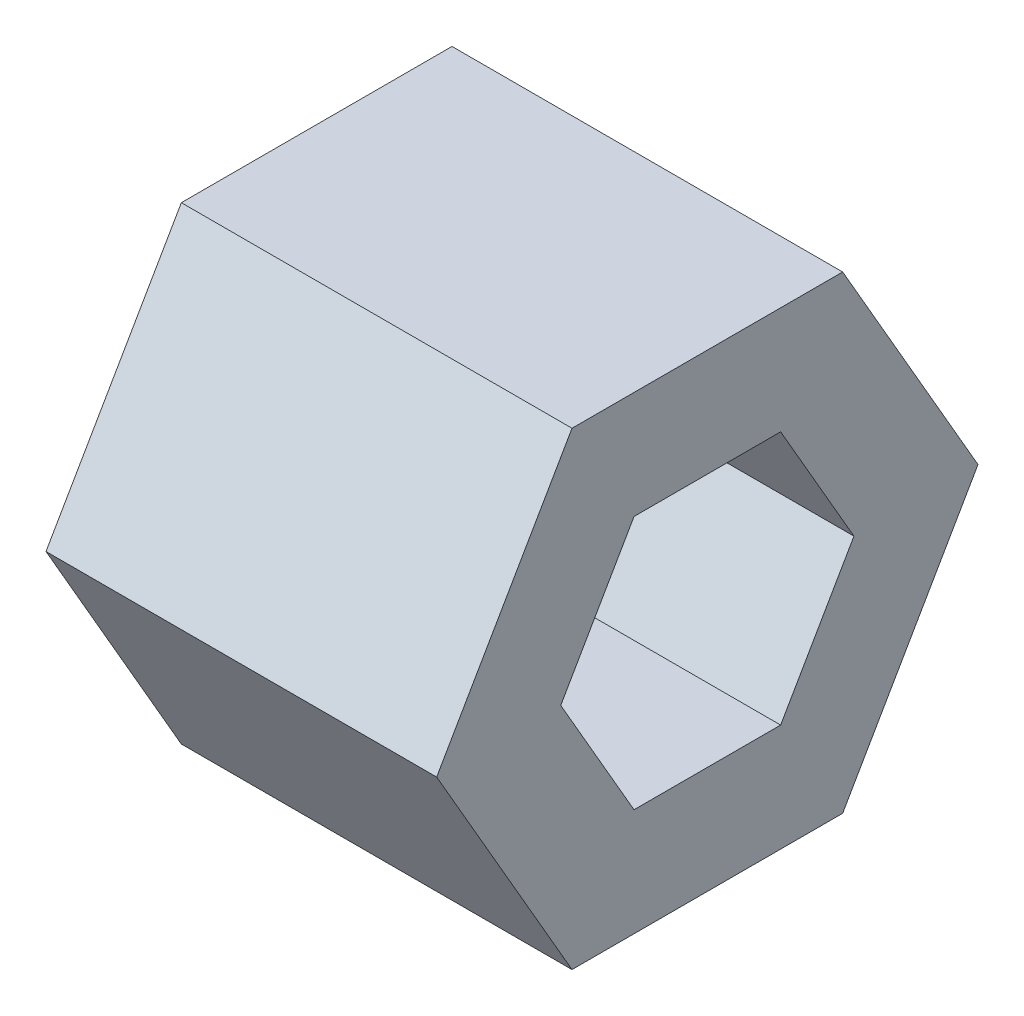
ISO-10303-21;
HEADER;
FILE_DESCRIPTION(('STEP AP214'),'2;1');
FILE_NAME('part.step','',(''),(''),'','','');
FILE_SCHEMA(('AUTOMOTIVE_DESIGN { 1 0 10303 214 1 1 1 1 }'));
ENDSEC;
DATA;
#1=APPLICATION_CONTEXT('core data for automotive mechanical design processes');
#2=APPLICATION_PROTOCOL_DEFINITION('international standard','automotive_design',2000,#1);
#3=PRODUCT_CONTEXT('',#1,'mechanical');
#4=PRODUCT('Part','Part','',(#3));
#5=PRODUCT_RELATED_PRODUCT_CATEGORY('part','',(#4));
#6=PRODUCT_DEFINITION_FORMATION('','',#4);
#7=PRODUCT_DEFINITION_CONTEXT('part definition',#1,'design');
#8=PRODUCT_DEFINITION('design','',#6,#7);
#9=PRODUCT_DEFINITION_SHAPE('','',#8);
#10=(LENGTH_UNIT() NAMED_UNIT(*) SI_UNIT(.MILLI.,.METRE.));
#11=(NAMED_UNIT(*) PLANE_ANGLE_UNIT() SI_UNIT($,.RADIAN.));
#12=(NAMED_UNIT(*) SI_UNIT($,.STERADIAN.) SOLID_ANGLE_UNIT());
#13=UNCERTAINTY_MEASURE_WITH_UNIT(LENGTH_MEASURE(1.E-05),#10,'distance_accuracy_value','');
#14=(GEOMETRIC_REPRESENTATION_CONTEXT(3) GLOBAL_UNCERTAINTY_ASSIGNED_CONTEXT((#13)) GLOBAL_UNIT_ASSIGNED_CONTEXT((#10,
#11,#12)) REPRESENTATION_CONTEXT('',''));
#15=CARTESIAN_POINT('',(0.,0.,0.));
#16=DIRECTION('',(0.,0.,1.));
#17=DIRECTION('',(1.,0.,0.));
#18=AXIS2_PLACEMENT_3D('',#15,#16,#17);
#19=CARTESIAN_POINT('',(10.,-5.99999999999996,-3.46410161513783));
#20=DIRECTION('',(0.,0.499999999999995,0.866025403784442));
#21=DIRECTION('',(0.,-0.866025403784442,0.499999999999995));
#22=AXIS2_PLACEMENT_3D('',#19,#20,#21);
#23=PLANE('',#22);
#24=DIRECTION('',(0.,0.866025403784442,-0.499999999999995));
#25=VECTOR('',#24,1.);
#26=CARTESIAN_POINT('',(0.,-5.99999999999996,-3.46410161513783));
#27=LINE('',#26,#25);
#28=CARTESIAN_POINT('',(0.,-5.99999999999996,-3.46410161513783));
#29=VERTEX_POINT('',#28);
#30=CARTESIAN_POINT('',(0.,0.,-6.92820323027551));
#31=VERTEX_POINT('',#30);
#32=EDGE_CURVE('E130',#29,#31,#27,.T.);
#33=ORIENTED_EDGE('',*,*,#32,.T.);
#34=DIRECTION('',(-1.,0.,0.));
#35=VECTOR('',#34,1.);
#36=CARTESIAN_POINT('',(10.,0.,-6.92820323027551));
#37=LINE('',#36,#35);
#38=CARTESIAN_POINT('',(10.,0.,-6.92820323027551));
#39=VERTEX_POINT('',#38);
#40=EDGE_CURVE('E11',#39,#31,#37,.T.);
#41=ORIENTED_EDGE('',*,*,#40,.F.);
#42=DIRECTION('',(0.,0.866025403784442,-0.499999999999995));
#43=VECTOR('',#42,1.);
#44=CARTESIAN_POINT('',(10.,-5.99999999999996,-3.46410161513783));
#45=LINE('',#44,#43);
#46=CARTESIAN_POINT('',(10.,-5.99999999999996,-3.46410161513783));
#47=VERTEX_POINT('',#46);
#48=EDGE_CURVE('E142',#47,#39,#45,.T.);
#49=ORIENTED_EDGE('',*,*,#48,.F.);
#50=DIRECTION('',(-1.,0.,0.));
#51=VECTOR('',#50,1.);
#52=CARTESIAN_POINT('',(10.,-5.99999999999996,-3.46410161513783));
#53=LINE('',#52,#51);
#54=EDGE_CURVE('E126',#47,#29,#53,.T.);
#55=ORIENTED_EDGE('',*,*,#54,.T.);
#56=EDGE_LOOP('',(#33,#41,#49,#55));
#57=FACE_BOUND('',#56,.T.);
#58=ADVANCED_FACE('F34',(#57),#23,.F.);
#59=CARTESIAN_POINT('',(10.,0.,-6.92820323027551));
#60=DIRECTION('',(0.,-0.500000000000001,0.866025403784438));
#61=DIRECTION('',(0.,-0.866025403784438,-0.500000000000001));
#62=AXIS2_PLACEMENT_3D('',#59,#60,#61);
#63=PLANE('',#62);
#64=DIRECTION('',(0.,0.866025403784438,0.500000000000001));
#65=VECTOR('',#64,1.);
#66=CARTESIAN_POINT('',(0.,0.,-6.92820323027551));
#67=LINE('',#66,#65);
#68=CARTESIAN_POINT('',(0.,6.00000000000001,-3.46410161513774));
#69=VERTEX_POINT('',#68);
#70=EDGE_CURVE('E133',#31,#69,#67,.T.);
#71=ORIENTED_EDGE('',*,*,#70,.T.);
#72=DIRECTION('',(-1.,0.,0.));
#73=VECTOR('',#72,1.);
#74=CARTESIAN_POINT('',(10.,6.00000000000001,-3.46410161513774));
#75=LINE('',#74,#73);
#76=CARTESIAN_POINT('',(10.,6.00000000000001,-3.46410161513774));
#77=VERTEX_POINT('',#76);
#78=EDGE_CURVE('E41',#77,#69,#75,.T.);
#79=ORIENTED_EDGE('',*,*,#78,.F.);
#80=DIRECTION('',(0.,0.866025403784438,0.500000000000001));
#81=VECTOR('',#80,1.);
#82=CARTESIAN_POINT('',(10.,0.,-6.92820323027551));
#83=LINE('',#82,#81);
#84=EDGE_CURVE('E92',#39,#77,#83,.T.);
#85=ORIENTED_EDGE('',*,*,#84,.F.);
#86=ORIENTED_EDGE('',*,*,#40,.T.);
#87=EDGE_LOOP('',(#71,#79,#85,#86));
#88=FACE_BOUND('',#87,.T.);
#89=ADVANCED_FACE('F277',(#88),#63,.F.);
#90=CARTESIAN_POINT('',(10.,6.00000000000001,-3.46410161513774));
#91=DIRECTION('',(0.,-1.,0.));
#92=DIRECTION('',(0.,0.,-1.));
#93=AXIS2_PLACEMENT_3D('',#90,#91,#92);
#94=PLANE('',#93);
#95=DIRECTION('',(0.,0.,1.));
#96=VECTOR('',#95,1.);
#97=CARTESIAN_POINT('',(0.,6.00000000000001,-3.46410161513774));
#98=LINE('',#97,#96);
#99=CARTESIAN_POINT('',(0.,5.99999999999999,3.46410161513779));
#100=VERTEX_POINT('',#99);
#101=EDGE_CURVE('E136',#69,#100,#98,.T.);
#102=ORIENTED_EDGE('',*,*,#101,.T.);
#103=DIRECTION('',(-1.,0.,0.));
#104=VECTOR('',#103,1.);
#105=CARTESIAN_POINT('',(10.,5.99999999999999,3.46410161513779));
#106=LINE('',#105,#104);
#107=CARTESIAN_POINT('',(10.,5.99999999999999,3.46410161513779));
#108=VERTEX_POINT('',#107);
#109=EDGE_CURVE('E121',#108,#100,#106,.T.);
#110=ORIENTED_EDGE('',*,*,#109,.F.);
#111=DIRECTION('',(0.,0.,1.));
#112=VECTOR('',#111,1.);
#113=CARTESIAN_POINT('',(10.,6.00000000000001,-3.46410161513774));
#114=LINE('',#113,#112);
#115=EDGE_CURVE('E109',#77,#108,#114,.T.);
#116=ORIENTED_EDGE('',*,*,#115,.F.);
#117=ORIENTED_EDGE('',*,*,#78,.T.);
#118=EDGE_LOOP('',(#102,#110,#116,#117));
#119=FACE_BOUND('',#118,.T.);
#120=ADVANCED_FACE('F148',(#119),#94,.F.);
#121=CARTESIAN_POINT('',(10.,5.99999999999999,3.46410161513779));
#122=DIRECTION('',(0.,-0.499999999999995,-0.866025403784442));
#123=DIRECTION('',(0.,0.866025403784442,-0.499999999999995));
#124=AXIS2_PLACEMENT_3D('',#121,#122,#123);
#125=PLANE('',#124);
#126=DIRECTION('',(0.,-0.866025403784441,0.499999999999995));
#127=VECTOR('',#126,1.);
#128=CARTESIAN_POINT('',(0.,5.99999999999999,3.46410161513779));
#129=LINE('',#128,#127);
#130=CARTESIAN_POINT('',(0.,0.,6.92820323027551));
#131=VERTEX_POINT('',#130);
#132=EDGE_CURVE('E118',#100,#131,#129,.T.);
#133=ORIENTED_EDGE('',*,*,#132,.T.);
#134=DIRECTION('',(-1.,0.,0.));
#135=VECTOR('',#134,1.);
#136=CARTESIAN_POINT('',(10.,0.,6.92820323027551));
#137=LINE('',#136,#135);
#138=CARTESIAN_POINT('',(10.,0.,6.92820323027551));
#139=VERTEX_POINT('',#138);
#140=EDGE_CURVE('E115',#139,#131,#137,.T.);
#141=ORIENTED_EDGE('',*,*,#140,.F.);
#142=DIRECTION('',(0.,-0.866025403784441,0.499999999999995));
#143=VECTOR('',#142,1.);
#144=CARTESIAN_POINT('',(10.,5.99999999999999,3.46410161513779));
#145=LINE('',#144,#143);
#146=EDGE_CURVE('E102',#108,#139,#145,.T.);
#147=ORIENTED_EDGE('',*,*,#146,.F.);
#148=ORIENTED_EDGE('',*,*,#109,.T.);
#149=EDGE_LOOP('',(#133,#141,#147,#148));
#150=FACE_BOUND('',#149,.T.);
#151=ADVANCED_FACE('F116',(#150),#125,.F.);
#152=CARTESIAN_POINT('',(10.,0.,6.92820323027551));
#153=DIRECTION('',(0.,0.500000000000007,-0.866025403784435));
#154=DIRECTION('',(0.,0.866025403784435,0.500000000000007));
#155=AXIS2_PLACEMENT_3D('',#152,#153,#154);
#156=PLANE('',#155);
#157=DIRECTION('',(0.,-0.866025403784434,-0.500000000000007));
#158=VECTOR('',#157,1.);
#159=CARTESIAN_POINT('',(0.,0.,6.92820323027551));
#160=LINE('',#159,#158);
#161=CARTESIAN_POINT('',(0.,-6.00000000000004,3.4641016151377));
#162=VERTEX_POINT('',#161);
#163=EDGE_CURVE('E139',#131,#162,#160,.T.);
#164=ORIENTED_EDGE('',*,*,#163,.T.);
#165=DIRECTION('',(-1.,0.,0.));
#166=VECTOR('',#165,1.);
#167=CARTESIAN_POINT('',(10.,-6.00000000000004,3.4641016151377));
#168=LINE('',#167,#166);
#169=CARTESIAN_POINT('',(10.,-6.00000000000004,3.4641016151377));
#170=VERTEX_POINT('',#169);
#171=EDGE_CURVE('E122',#170,#162,#168,.T.);
#172=ORIENTED_EDGE('',*,*,#171,.F.);
#173=DIRECTION('',(0.,-0.866025403784434,-0.500000000000007));
#174=VECTOR('',#173,1.);
#175=CARTESIAN_POINT('',(10.,0.,6.92820323027551));
#176=LINE('',#175,#174);
#177=EDGE_CURVE('E106',#139,#170,#176,.T.);
#178=ORIENTED_EDGE('',*,*,#177,.F.);
#179=ORIENTED_EDGE('',*,*,#140,.T.);
#180=EDGE_LOOP('',(#164,#172,#178,#179));
#181=FACE_BOUND('',#180,.T.);
#182=ADVANCED_FACE('F124',(#181),#156,.F.);
#183=CARTESIAN_POINT('',(10.,-6.00000000000004,3.4641016151377));
#184=DIRECTION('',(0.,1.,0.));
#185=DIRECTION('',(0.,0.,1.));
#186=AXIS2_PLACEMENT_3D('',#183,#184,#185);
#187=PLANE('',#186);
#188=DIRECTION('',(0.,0.,-1.));
#189=VECTOR('',#188,1.);
#190=CARTESIAN_POINT('',(0.,-6.00000000000004,3.4641016151377));
#191=LINE('',#190,#189);
#192=EDGE_CURVE('E84',#162,#29,#191,.T.);
#193=ORIENTED_EDGE('',*,*,#192,.T.);
#194=ORIENTED_EDGE('',*,*,#54,.F.);
#195=DIRECTION('',(0.,0.,-1.));
#196=VECTOR('',#195,1.);
#197=CARTESIAN_POINT('',(10.,-6.00000000000004,3.4641016151377));
#198=LINE('',#197,#196);
#199=EDGE_CURVE('E57',#170,#47,#198,.T.);
#200=ORIENTED_EDGE('',*,*,#199,.F.);
#201=ORIENTED_EDGE('',*,*,#171,.T.);
#202=EDGE_LOOP('',(#193,#194,#200,#201));
#203=FACE_BOUND('',#202,.T.);
#204=ADVANCED_FACE('F152',(#203),#187,.F.);
#205=CARTESIAN_POINT('',(10.,0.,0.));
#206=DIRECTION('',(1.,0.,0.));
#207=DIRECTION('',(0.,0.,-1.));
#208=AXIS2_PLACEMENT_3D('',#205,#206,#207);
#209=PLANE('',#208);
#210=DIRECTION('',(0.,0.866025403784439,-0.5));
#211=VECTOR('',#210,1.);
#212=CARTESIAN_POINT('',(10.,-3.25,-1.87638837486628));
#213=LINE('',#212,#211);
#214=CARTESIAN_POINT('',(10.,-3.25,-1.87638837486628));
#215=VERTEX_POINT('',#214);
#216=CARTESIAN_POINT('',(10.,0.,-3.75277674973257));
#217=VERTEX_POINT('',#216);
#218=EDGE_CURVE('E48',#215,#217,#213,.T.);
#219=ORIENTED_EDGE('',*,*,#218,.F.);
#220=DIRECTION('',(0.,0.,-1.));
#221=VECTOR('',#220,1.);
#222=CARTESIAN_POINT('',(10.,-3.25,1.87638837486628));
#223=LINE('',#222,#221);
#224=CARTESIAN_POINT('',(10.,-3.25,1.87638837486628));
#225=VERTEX_POINT('',#224);
#226=EDGE_CURVE('E175',#225,#215,#223,.T.);
#227=ORIENTED_EDGE('',*,*,#226,.F.);
#228=DIRECTION('',(0.,-0.866025403784438,-0.5));
#229=VECTOR('',#228,1.);
#230=CARTESIAN_POINT('',(10.,0.,3.75277674973257));
#231=LINE('',#230,#229);
#232=CARTESIAN_POINT('',(10.,0.,3.75277674973257));
#233=VERTEX_POINT('',#232);
#234=EDGE_CURVE('E179',#233,#225,#231,.T.);
#235=ORIENTED_EDGE('',*,*,#234,.F.);
#236=DIRECTION('',(0.,-0.866025403784439,0.5));
#237=VECTOR('',#236,1.);
#238=CARTESIAN_POINT('',(10.,3.25,1.87638837486628));
#239=LINE('',#238,#237);
#240=CARTESIAN_POINT('',(10.,3.25,1.87638837486628));
#241=VERTEX_POINT('',#240);
#242=EDGE_CURVE('E182',#241,#233,#239,.T.);
#243=ORIENTED_EDGE('',*,*,#242,.F.);
#244=DIRECTION('',(0.,0.,1.));
#245=VECTOR('',#244,1.);
#246=CARTESIAN_POINT('',(10.,3.25,-1.87638837486628));
#247=LINE('',#246,#245);
#248=CARTESIAN_POINT('',(10.,3.25,-1.87638837486628));
#249=VERTEX_POINT('',#248);
#250=EDGE_CURVE('E185',#249,#241,#247,.T.);
#251=ORIENTED_EDGE('',*,*,#250,.F.);
#252=DIRECTION('',(0.,0.866025403784439,0.5));
#253=VECTOR('',#252,1.);
#254=CARTESIAN_POINT('',(10.,0.,-3.75277674973257));
#255=LINE('',#254,#253);
#256=EDGE_CURVE('E188',#217,#249,#255,.T.);
#257=ORIENTED_EDGE('',*,*,#256,.F.);
#258=EDGE_LOOP('',(#219,#227,#235,#243,#251,#257));
#259=FACE_BOUND('',#258,.T.);
#260=ORIENTED_EDGE('',*,*,#48,.T.);
#261=ORIENTED_EDGE('',*,*,#84,.T.);
#262=ORIENTED_EDGE('',*,*,#115,.T.);
#263=ORIENTED_EDGE('',*,*,#146,.T.);
#264=ORIENTED_EDGE('',*,*,#177,.T.);
#265=ORIENTED_EDGE('',*,*,#199,.T.);
#266=EDGE_LOOP('',(#260,#261,#262,#263,#264,#265));
#267=FACE_BOUND('',#266,.T.);
#268=ADVANCED_FACE('F104',(#259,#267),#209,.T.);
#269=CARTESIAN_POINT('',(0.,0.,0.));
#270=DIRECTION('',(1.,0.,0.));
#271=DIRECTION('',(0.,0.,-1.));
#272=AXIS2_PLACEMENT_3D('',#269,#270,#271);
#273=PLANE('',#272);
#274=CARTESIAN_POINT('',(0.,0.,0.));
#275=DIRECTION('',(1.,0.,0.));
#276=DIRECTION('',(0.,0.,-1.));
#277=AXIS2_PLACEMENT_3D('',#274,#275,#276);
#278=CIRCLE('',#277,1.5);
#279=CARTESIAN_POINT('',(0.,0.,-1.5));
#280=VERTEX_POINT('',#279);
#281=EDGE_CURVE('E192',#280,#280,#278,.T.);
#282=ORIENTED_EDGE('',*,*,#281,.T.);
#283=EDGE_LOOP('',(#282));
#284=FACE_BOUND('',#283,.T.);
#285=ORIENTED_EDGE('',*,*,#32,.F.);
#286=ORIENTED_EDGE('',*,*,#192,.F.);
#287=ORIENTED_EDGE('',*,*,#163,.F.);
#288=ORIENTED_EDGE('',*,*,#132,.F.);
#289=ORIENTED_EDGE('',*,*,#101,.F.);
#290=ORIENTED_EDGE('',*,*,#70,.F.);
#291=EDGE_LOOP('',(#285,#286,#287,#288,#289,#290));
#292=FACE_BOUND('',#291,.T.);
#293=ADVANCED_FACE('F151',(#284,#292),#273,.F.);
#294=CARTESIAN_POINT('',(3.,-3.25,-1.87638837486628));
#295=DIRECTION('',(0.,-0.5,-0.866025403784439));
#296=DIRECTION('',(0.,0.866025403784439,-0.5));
#297=AXIS2_PLACEMENT_3D('',#294,#295,#296);
#298=PLANE('',#297);
#299=ORIENTED_EDGE('',*,*,#218,.T.);
#300=DIRECTION('',(1.,0.,0.));
#301=VECTOR('',#300,1.);
#302=CARTESIAN_POINT('',(3.,0.,-3.75277674973257));
#303=LINE('',#302,#301);
#304=CARTESIAN_POINT('',(3.,0.,-3.75277674973257));
#305=VERTEX_POINT('',#304);
#306=EDGE_CURVE('E159',#305,#217,#303,.T.);
#307=ORIENTED_EDGE('',*,*,#306,.F.);
#308=DIRECTION('',(0.,0.866025403784439,-0.5));
#309=VECTOR('',#308,1.);
#310=CARTESIAN_POINT('',(3.,-3.25,-1.87638837486628));
#311=LINE('',#310,#309);
#312=CARTESIAN_POINT('',(3.,-3.25,-1.87638837486628));
#313=VERTEX_POINT('',#312);
#314=EDGE_CURVE('E178',#313,#305,#311,.T.);
#315=ORIENTED_EDGE('',*,*,#314,.F.);
#316=DIRECTION('',(1.,0.,0.));
#317=VECTOR('',#316,1.);
#318=CARTESIAN_POINT('',(3.,-3.25,-1.87638837486628));
#319=LINE('',#318,#317);
#320=EDGE_CURVE('E134',#313,#215,#319,.T.);
#321=ORIENTED_EDGE('',*,*,#320,.T.);
#322=EDGE_LOOP('',(#299,#307,#315,#321));
#323=FACE_BOUND('',#322,.T.);
#324=ADVANCED_FACE('F229',(#323),#298,.F.);
#325=CARTESIAN_POINT('',(3.,-3.25,1.87638837486628));
#326=DIRECTION('',(0.,-1.,0.));
#327=DIRECTION('',(0.,0.,-1.));
#328=AXIS2_PLACEMENT_3D('',#325,#326,#327);
#329=PLANE('',#328);
#330=ORIENTED_EDGE('',*,*,#226,.T.);
#331=ORIENTED_EDGE('',*,*,#320,.F.);
#332=DIRECTION('',(0.,0.,-1.));
#333=VECTOR('',#332,1.);
#334=CARTESIAN_POINT('',(3.,-3.25,1.87638837486628));
#335=LINE('',#334,#333);
#336=CARTESIAN_POINT('',(3.,-3.25,1.87638837486628));
#337=VERTEX_POINT('',#336);
#338=EDGE_CURVE('E162',#337,#313,#335,.T.);
#339=ORIENTED_EDGE('',*,*,#338,.F.);
#340=DIRECTION('',(1.,0.,0.));
#341=VECTOR('',#340,1.);
#342=CARTESIAN_POINT('',(3.,-3.25,1.87638837486628));
#343=LINE('',#342,#341);
#344=EDGE_CURVE('E171',#337,#225,#343,.T.);
#345=ORIENTED_EDGE('',*,*,#344,.T.);
#346=EDGE_LOOP('',(#330,#331,#339,#345));
#347=FACE_BOUND('',#346,.T.);
#348=ADVANCED_FACE('F245',(#347),#329,.F.);
#349=CARTESIAN_POINT('',(3.,0.,3.75277674973257));
#350=DIRECTION('',(0.,-0.5,0.866025403784438));
#351=DIRECTION('',(0.,-0.866025403784439,-0.5));
#352=AXIS2_PLACEMENT_3D('',#349,#350,#351);
#353=PLANE('',#352);
#354=ORIENTED_EDGE('',*,*,#234,.T.);
#355=ORIENTED_EDGE('',*,*,#344,.F.);
#356=DIRECTION('',(0.,-0.866025403784438,-0.5));
#357=VECTOR('',#356,1.);
#358=CARTESIAN_POINT('',(3.,0.,3.75277674973257));
#359=LINE('',#358,#357);
#360=CARTESIAN_POINT('',(3.,0.,3.75277674973257));
#361=VERTEX_POINT('',#360);
#362=EDGE_CURVE('E195',#361,#337,#359,.T.);
#363=ORIENTED_EDGE('',*,*,#362,.F.);
#364=DIRECTION('',(1.,0.,0.));
#365=VECTOR('',#364,1.);
#366=CARTESIAN_POINT('',(3.,0.,3.75277674973257));
#367=LINE('',#366,#365);
#368=EDGE_CURVE('E168',#361,#233,#367,.T.);
#369=ORIENTED_EDGE('',*,*,#368,.T.);
#370=EDGE_LOOP('',(#354,#355,#363,#369));
#371=FACE_BOUND('',#370,.T.);
#372=ADVANCED_FACE('F250',(#371),#353,.F.);
#373=CARTESIAN_POINT('',(3.,3.25,1.87638837486628));
#374=DIRECTION('',(0.,0.5,0.866025403784439));
#375=DIRECTION('',(0.,-0.866025403784439,0.5));
#376=AXIS2_PLACEMENT_3D('',#373,#374,#375);
#377=PLANE('',#376);
#378=ORIENTED_EDGE('',*,*,#242,.T.);
#379=ORIENTED_EDGE('',*,*,#368,.F.);
#380=DIRECTION('',(0.,-0.866025403784439,0.5));
#381=VECTOR('',#380,1.);
#382=CARTESIAN_POINT('',(3.,3.25,1.87638837486628));
#383=LINE('',#382,#381);
#384=CARTESIAN_POINT('',(3.,3.25,1.87638837486628));
#385=VERTEX_POINT('',#384);
#386=EDGE_CURVE('E198',#385,#361,#383,.T.);
#387=ORIENTED_EDGE('',*,*,#386,.F.);
#388=DIRECTION('',(1.,0.,0.));
#389=VECTOR('',#388,1.);
#390=CARTESIAN_POINT('',(3.,3.25,1.87638837486628));
#391=LINE('',#390,#389);
#392=EDGE_CURVE('E165',#385,#241,#391,.T.);
#393=ORIENTED_EDGE('',*,*,#392,.T.);
#394=EDGE_LOOP('',(#378,#379,#387,#393));
#395=FACE_BOUND('',#394,.T.);
#396=ADVANCED_FACE('F267',(#395),#377,.F.);
#397=CARTESIAN_POINT('',(3.,3.25,-1.87638837486628));
#398=DIRECTION('',(0.,1.,0.));
#399=DIRECTION('',(0.,0.,1.));
#400=AXIS2_PLACEMENT_3D('',#397,#398,#399);
#401=PLANE('',#400);
#402=ORIENTED_EDGE('',*,*,#250,.T.);
#403=ORIENTED_EDGE('',*,*,#392,.F.);
#404=DIRECTION('',(0.,0.,1.));
#405=VECTOR('',#404,1.);
#406=CARTESIAN_POINT('',(3.,3.25,-1.87638837486628));
#407=LINE('',#406,#405);
#408=CARTESIAN_POINT('',(3.,3.25,-1.87638837486628));
#409=VERTEX_POINT('',#408);
#410=EDGE_CURVE('E201',#409,#385,#407,.T.);
#411=ORIENTED_EDGE('',*,*,#410,.F.);
#412=DIRECTION('',(1.,0.,0.));
#413=VECTOR('',#412,1.);
#414=CARTESIAN_POINT('',(3.,3.25,-1.87638837486628));
#415=LINE('',#414,#413);
#416=EDGE_CURVE('E161',#409,#249,#415,.T.);
#417=ORIENTED_EDGE('',*,*,#416,.T.);
#418=EDGE_LOOP('',(#402,#403,#411,#417));
#419=FACE_BOUND('',#418,.T.);
#420=ADVANCED_FACE('F263',(#419),#401,.F.);
#421=CARTESIAN_POINT('',(3.,0.,-3.75277674973257));
#422=DIRECTION('',(0.,0.5,-0.866025403784438));
#423=DIRECTION('',(0.,0.866025403784438,0.5));
#424=AXIS2_PLACEMENT_3D('',#421,#422,#423);
#425=PLANE('',#424);
#426=ORIENTED_EDGE('',*,*,#256,.T.);
#427=ORIENTED_EDGE('',*,*,#416,.F.);
#428=DIRECTION('',(0.,0.866025403784439,0.5));
#429=VECTOR('',#428,1.);
#430=CARTESIAN_POINT('',(3.,0.,-3.75277674973257));
#431=LINE('',#430,#429);
#432=EDGE_CURVE('E204',#305,#409,#431,.T.);
#433=ORIENTED_EDGE('',*,*,#432,.F.);
#434=ORIENTED_EDGE('',*,*,#306,.T.);
#435=EDGE_LOOP('',(#426,#427,#433,#434));
#436=FACE_BOUND('',#435,.T.);
#437=ADVANCED_FACE('F221',(#436),#425,.F.);
#438=CARTESIAN_POINT('',(3.,0.,0.));
#439=DIRECTION('',(1.,0.,0.));
#440=DIRECTION('',(0.,0.,-1.));
#441=AXIS2_PLACEMENT_3D('',#438,#439,#440);
#442=PLANE('',#441);
#443=CARTESIAN_POINT('',(3.,0.,0.));
#444=DIRECTION('',(1.,0.,0.));
#445=DIRECTION('',(0.,0.,-1.));
#446=AXIS2_PLACEMENT_3D('',#443,#444,#445);
#447=CIRCLE('',#446,1.5);
#448=CARTESIAN_POINT('',(3.,0.,-1.5));
#449=VERTEX_POINT('',#448);
#450=EDGE_CURVE('E211',#449,#449,#447,.T.);
#451=ORIENTED_EDGE('',*,*,#450,.F.);
#452=EDGE_LOOP('',(#451));
#453=FACE_BOUND('',#452,.T.);
#454=ORIENTED_EDGE('',*,*,#314,.T.);
#455=ORIENTED_EDGE('',*,*,#432,.T.);
#456=ORIENTED_EDGE('',*,*,#410,.T.);
#457=ORIENTED_EDGE('',*,*,#386,.T.);
#458=ORIENTED_EDGE('',*,*,#362,.T.);
#459=ORIENTED_EDGE('',*,*,#338,.T.);
#460=EDGE_LOOP('',(#454,#455,#456,#457,#458,#459));
#461=FACE_BOUND('',#460,.T.);
#462=ADVANCED_FACE('F218',(#453,#461),#442,.T.);
#463=CARTESIAN_POINT('',(-4.,0.,0.));
#464=DIRECTION('',(1.,0.,0.));
#465=DIRECTION('',(0.,0.,-1.));
#466=AXIS2_PLACEMENT_3D('',#463,#464,#465);
#467=CYLINDRICAL_SURFACE('',#466,1.5);
#468=ORIENTED_EDGE('',*,*,#450,.T.);
#469=EDGE_LOOP('',(#468));
#470=FACE_BOUND('',#469,.T.);
#471=ORIENTED_EDGE('',*,*,#281,.F.);
#472=EDGE_LOOP('',(#471));
#473=FACE_BOUND('',#472,.T.);
#474=ADVANCED_FACE('F215',(#470,#473),#467,.F.);
#475=CLOSED_SHELL('',(#58,#89,#120,#151,#182,#204,#268,#293,#324,#348,#372,#396,#420,#437,#462,#474));
#476=MANIFOLD_SOLID_BREP('B2',#475);
#477=ADVANCED_BREP_SHAPE_REPRESENTATION('',(#18,#476),#14);
#478=SHAPE_DEFINITION_REPRESENTATION(#9,#477);
ENDSEC;
END-ISO-10303-21;
